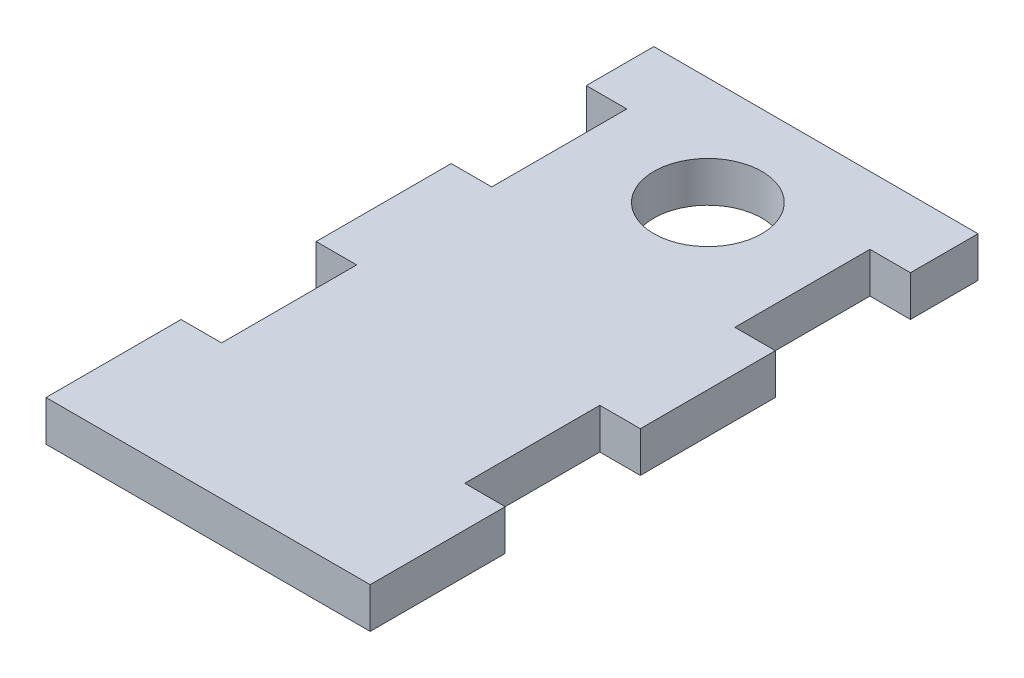
ISO-10303-21;
HEADER;
FILE_DESCRIPTION(('STEP AP214'),'2;1');
FILE_NAME('part.step','',(''),(''),'','','');
FILE_SCHEMA(('AUTOMOTIVE_DESIGN { 1 0 10303 214 1 1 1 1 }'));
ENDSEC;
DATA;
#1=APPLICATION_CONTEXT('core data for automotive mechanical design processes');
#2=APPLICATION_PROTOCOL_DEFINITION('international standard','automotive_design',2000,#1);
#3=PRODUCT_CONTEXT('',#1,'mechanical');
#4=PRODUCT('Part','Part','',(#3));
#5=PRODUCT_RELATED_PRODUCT_CATEGORY('part','',(#4));
#6=PRODUCT_DEFINITION_FORMATION('','',#4);
#7=PRODUCT_DEFINITION_CONTEXT('part definition',#1,'design');
#8=PRODUCT_DEFINITION('design','',#6,#7);
#9=PRODUCT_DEFINITION_SHAPE('','',#8);
#10=(LENGTH_UNIT() NAMED_UNIT(*) SI_UNIT(.MILLI.,.METRE.));
#11=(NAMED_UNIT(*) PLANE_ANGLE_UNIT() SI_UNIT($,.RADIAN.));
#12=(NAMED_UNIT(*) SI_UNIT($,.STERADIAN.) SOLID_ANGLE_UNIT());
#13=UNCERTAINTY_MEASURE_WITH_UNIT(LENGTH_MEASURE(1.E-05),#10,'distance_accuracy_value','');
#14=(GEOMETRIC_REPRESENTATION_CONTEXT(3) GLOBAL_UNCERTAINTY_ASSIGNED_CONTEXT((#13)) GLOBAL_UNIT_ASSIGNED_CONTEXT((#10,
#11,#12)) REPRESENTATION_CONTEXT('',''));
#15=CARTESIAN_POINT('',(0.,0.,0.));
#16=DIRECTION('',(0.,0.,1.));
#17=DIRECTION('',(1.,0.,0.));
#18=AXIS2_PLACEMENT_3D('',#15,#16,#17);
#19=CARTESIAN_POINT('',(12.,3.,22.5));
#20=DIRECTION('',(-1.,0.,0.));
#21=DIRECTION('',(0.,0.,1.));
#22=AXIS2_PLACEMENT_3D('',#19,#20,#21);
#23=PLANE('',#22);
#24=DIRECTION('',(0.,0.,-1.));
#25=VECTOR('',#24,1.);
#26=CARTESIAN_POINT('',(12.,0.,22.5));
#27=LINE('',#26,#25);
#28=CARTESIAN_POINT('',(12.,0.,22.5));
#29=VERTEX_POINT('',#28);
#30=CARTESIAN_POINT('',(12.,0.,12.5));
#31=VERTEX_POINT('',#30);
#32=EDGE_CURVE('E185',#29,#31,#27,.T.);
#33=ORIENTED_EDGE('',*,*,#32,.T.);
#34=DIRECTION('',(0.,1.,0.));
#35=VECTOR('',#34,1.);
#36=CARTESIAN_POINT('',(12.,0.,12.5));
#37=LINE('',#36,#35);
#38=CARTESIAN_POINT('',(12.,3.,12.5));
#39=VERTEX_POINT('',#38);
#40=EDGE_CURVE('E169',#31,#39,#37,.T.);
#41=ORIENTED_EDGE('',*,*,#40,.T.);
#42=DIRECTION('',(0.,0.,-1.));
#43=VECTOR('',#42,1.);
#44=CARTESIAN_POINT('',(12.,3.,22.5));
#45=LINE('',#44,#43);
#46=CARTESIAN_POINT('',(12.,3.,22.5));
#47=VERTEX_POINT('',#46);
#48=EDGE_CURVE('E215',#47,#39,#45,.T.);
#49=ORIENTED_EDGE('',*,*,#48,.F.);
#50=DIRECTION('',(0.,-1.,0.));
#51=VECTOR('',#50,1.);
#52=CARTESIAN_POINT('',(12.,3.,22.5));
#53=LINE('',#52,#51);
#54=EDGE_CURVE('E40',#47,#29,#53,.T.);
#55=ORIENTED_EDGE('',*,*,#54,.T.);
#56=EDGE_LOOP('',(#33,#41,#49,#55));
#57=FACE_BOUND('',#56,.T.);
#58=ADVANCED_FACE('F32',(#57),#23,.F.);
#59=CARTESIAN_POINT('',(12.,3.,2.50000000000002));
#60=VERTEX_POINT('',#59);
#61=CARTESIAN_POINT('',(12.,3.,-7.49999999999998));
#62=VERTEX_POINT('',#61);
#63=EDGE_CURVE('E217',#60,#62,#45,.T.);
#64=ORIENTED_EDGE('',*,*,#63,.F.);
#65=DIRECTION('',(0.,1.,0.));
#66=VECTOR('',#65,1.);
#67=CARTESIAN_POINT('',(12.,0.,2.50000000000002));
#68=LINE('',#67,#66);
#69=CARTESIAN_POINT('',(12.,0.,2.50000000000002));
#70=VERTEX_POINT('',#69);
#71=EDGE_CURVE('E179',#70,#60,#68,.T.);
#72=ORIENTED_EDGE('',*,*,#71,.F.);
#73=CARTESIAN_POINT('',(12.,0.,-7.49999999999998));
#74=VERTEX_POINT('',#73);
#75=EDGE_CURVE('E193',#70,#74,#27,.T.);
#76=ORIENTED_EDGE('',*,*,#75,.T.);
#77=DIRECTION('',(0.,1.,0.));
#78=VECTOR('',#77,1.);
#79=CARTESIAN_POINT('',(12.,0.,-7.49999999999998));
#80=LINE('',#79,#78);
#81=EDGE_CURVE('E285',#74,#62,#80,.T.);
#82=ORIENTED_EDGE('',*,*,#81,.T.);
#83=EDGE_LOOP('',(#64,#72,#76,#82));
#84=FACE_BOUND('',#83,.T.);
#85=ADVANCED_FACE('F328',(#84),#23,.F.);
#86=CARTESIAN_POINT('',(-12.,3.,22.5));
#87=DIRECTION('',(1.,0.,0.));
#88=DIRECTION('',(0.,0.,-1.));
#89=AXIS2_PLACEMENT_3D('',#86,#87,#88);
#90=PLANE('',#89);
#91=DIRECTION('',(0.,0.,1.));
#92=VECTOR('',#91,1.);
#93=CARTESIAN_POINT('',(-12.,0.,22.5));
#94=LINE('',#93,#92);
#95=CARTESIAN_POINT('',(-12.,0.,-22.5));
#96=VERTEX_POINT('',#95);
#97=CARTESIAN_POINT('',(-12.,0.,-17.5));
#98=VERTEX_POINT('',#97);
#99=EDGE_CURVE('E205',#96,#98,#94,.T.);
#100=ORIENTED_EDGE('',*,*,#99,.T.);
#101=DIRECTION('',(0.,1.,0.));
#102=VECTOR('',#101,1.);
#103=CARTESIAN_POINT('',(-12.,0.,-17.5));
#104=LINE('',#103,#102);
#105=CARTESIAN_POINT('',(-12.,3.,-17.5));
#106=VERTEX_POINT('',#105);
#107=EDGE_CURVE('E256',#98,#106,#104,.T.);
#108=ORIENTED_EDGE('',*,*,#107,.T.);
#109=DIRECTION('',(0.,0.,1.));
#110=VECTOR('',#109,1.);
#111=CARTESIAN_POINT('',(-12.,3.,22.5));
#112=LINE('',#111,#110);
#113=CARTESIAN_POINT('',(-12.,3.,-22.5));
#114=VERTEX_POINT('',#113);
#115=EDGE_CURVE('E221',#114,#106,#112,.T.);
#116=ORIENTED_EDGE('',*,*,#115,.F.);
#117=DIRECTION('',(0.,-1.,0.));
#118=VECTOR('',#117,1.);
#119=CARTESIAN_POINT('',(-12.,3.,-22.5));
#120=LINE('',#119,#118);
#121=EDGE_CURVE('E214',#114,#96,#120,.T.);
#122=ORIENTED_EDGE('',*,*,#121,.T.);
#123=EDGE_LOOP('',(#100,#108,#116,#122));
#124=FACE_BOUND('',#123,.T.);
#125=ADVANCED_FACE('F350',(#124),#90,.F.);
#126=CARTESIAN_POINT('',(-12.,3.,-7.49999999999999));
#127=VERTEX_POINT('',#126);
#128=CARTESIAN_POINT('',(-12.,3.,2.50000000000001));
#129=VERTEX_POINT('',#128);
#130=EDGE_CURVE('E224',#127,#129,#112,.T.);
#131=ORIENTED_EDGE('',*,*,#130,.F.);
#132=DIRECTION('',(0.,1.,0.));
#133=VECTOR('',#132,1.);
#134=CARTESIAN_POINT('',(-12.,0.,-7.49999999999999));
#135=LINE('',#134,#133);
#136=CARTESIAN_POINT('',(-12.,0.,-7.49999999999999));
#137=VERTEX_POINT('',#136);
#138=EDGE_CURVE('E259',#137,#127,#135,.T.);
#139=ORIENTED_EDGE('',*,*,#138,.F.);
#140=CARTESIAN_POINT('',(-12.,0.,2.50000000000001));
#141=VERTEX_POINT('',#140);
#142=EDGE_CURVE('E208',#137,#141,#94,.T.);
#143=ORIENTED_EDGE('',*,*,#142,.T.);
#144=DIRECTION('',(0.,1.,0.));
#145=VECTOR('',#144,1.);
#146=CARTESIAN_POINT('',(-12.,0.,2.50000000000001));
#147=LINE('',#146,#145);
#148=EDGE_CURVE('E232',#141,#129,#147,.T.);
#149=ORIENTED_EDGE('',*,*,#148,.T.);
#150=EDGE_LOOP('',(#131,#139,#143,#149));
#151=FACE_BOUND('',#150,.T.);
#152=ADVANCED_FACE('F366',(#151),#90,.F.);
#153=CARTESIAN_POINT('',(-12.,3.,12.5));
#154=VERTEX_POINT('',#153);
#155=CARTESIAN_POINT('',(-12.,3.,22.5));
#156=VERTEX_POINT('',#155);
#157=EDGE_CURVE('E196',#154,#156,#112,.T.);
#158=ORIENTED_EDGE('',*,*,#157,.F.);
#159=DIRECTION('',(0.,1.,0.));
#160=VECTOR('',#159,1.);
#161=CARTESIAN_POINT('',(-12.,0.,12.5));
#162=LINE('',#161,#160);
#163=CARTESIAN_POINT('',(-12.,0.,12.5));
#164=VERTEX_POINT('',#163);
#165=EDGE_CURVE('E225',#164,#154,#162,.T.);
#166=ORIENTED_EDGE('',*,*,#165,.F.);
#167=CARTESIAN_POINT('',(-12.,0.,22.5));
#168=VERTEX_POINT('',#167);
#169=EDGE_CURVE('E210',#164,#168,#94,.T.);
#170=ORIENTED_EDGE('',*,*,#169,.T.);
#171=DIRECTION('',(0.,-1.,0.));
#172=VECTOR('',#171,1.);
#173=CARTESIAN_POINT('',(-12.,3.,22.5));
#174=LINE('',#173,#172);
#175=EDGE_CURVE('E11',#156,#168,#174,.T.);
#176=ORIENTED_EDGE('',*,*,#175,.F.);
#177=EDGE_LOOP('',(#158,#166,#170,#176));
#178=FACE_BOUND('',#177,.T.);
#179=ADVANCED_FACE('F34',(#178),#90,.F.);
#180=CARTESIAN_POINT('',(12.,3.,22.5));
#181=DIRECTION('',(0.,0.,-1.));
#182=DIRECTION('',(-1.,0.,0.));
#183=AXIS2_PLACEMENT_3D('',#180,#181,#182);
#184=PLANE('',#183);
#185=DIRECTION('',(1.,0.,0.));
#186=VECTOR('',#185,1.);
#187=CARTESIAN_POINT('',(12.,0.,22.5));
#188=LINE('',#187,#186);
#189=EDGE_CURVE('E199',#168,#29,#188,.T.);
#190=ORIENTED_EDGE('',*,*,#189,.T.);
#191=ORIENTED_EDGE('',*,*,#54,.F.);
#192=DIRECTION('',(1.,0.,0.));
#193=VECTOR('',#192,1.);
#194=CARTESIAN_POINT('',(12.,3.,22.5));
#195=LINE('',#194,#193);
#196=EDGE_CURVE('E219',#156,#47,#195,.T.);
#197=ORIENTED_EDGE('',*,*,#196,.F.);
#198=ORIENTED_EDGE('',*,*,#175,.T.);
#199=EDGE_LOOP('',(#190,#191,#197,#198));
#200=FACE_BOUND('',#199,.T.);
#201=ADVANCED_FACE('F376',(#200),#184,.F.);
#202=CARTESIAN_POINT('',(12.,3.,-17.5));
#203=VERTEX_POINT('',#202);
#204=CARTESIAN_POINT('',(12.,3.,-22.5));
#205=VERTEX_POINT('',#204);
#206=EDGE_CURVE('E218',#203,#205,#45,.T.);
#207=ORIENTED_EDGE('',*,*,#206,.F.);
#208=DIRECTION('',(0.,1.,0.));
#209=VECTOR('',#208,1.);
#210=CARTESIAN_POINT('',(12.,0.,-17.5));
#211=LINE('',#210,#209);
#212=CARTESIAN_POINT('',(12.,0.,-17.5));
#213=VERTEX_POINT('',#212);
#214=EDGE_CURVE('E288',#213,#203,#211,.T.);
#215=ORIENTED_EDGE('',*,*,#214,.F.);
#216=CARTESIAN_POINT('',(12.,0.,-22.5));
#217=VERTEX_POINT('',#216);
#218=EDGE_CURVE('E195',#213,#217,#27,.T.);
#219=ORIENTED_EDGE('',*,*,#218,.T.);
#220=DIRECTION('',(0.,-1.,0.));
#221=VECTOR('',#220,1.);
#222=CARTESIAN_POINT('',(12.,3.,-22.5));
#223=LINE('',#222,#221);
#224=EDGE_CURVE('E339',#205,#217,#223,.T.);
#225=ORIENTED_EDGE('',*,*,#224,.F.);
#226=EDGE_LOOP('',(#207,#215,#219,#225));
#227=FACE_BOUND('',#226,.T.);
#228=ADVANCED_FACE('F340',(#227),#23,.F.);
#229=CARTESIAN_POINT('',(12.,3.,-22.5));
#230=DIRECTION('',(0.,0.,1.));
#231=DIRECTION('',(1.,0.,0.));
#232=AXIS2_PLACEMENT_3D('',#229,#230,#231);
#233=PLANE('',#232);
#234=DIRECTION('',(-1.,0.,0.));
#235=VECTOR('',#234,1.);
#236=CARTESIAN_POINT('',(12.,0.,-22.5));
#237=LINE('',#236,#235);
#238=EDGE_CURVE('E192',#217,#96,#237,.T.);
#239=ORIENTED_EDGE('',*,*,#238,.T.);
#240=ORIENTED_EDGE('',*,*,#121,.F.);
#241=DIRECTION('',(-1.,0.,0.));
#242=VECTOR('',#241,1.);
#243=CARTESIAN_POINT('',(12.,3.,-22.5));
#244=LINE('',#243,#242);
#245=EDGE_CURVE('E212',#205,#114,#244,.T.);
#246=ORIENTED_EDGE('',*,*,#245,.F.);
#247=ORIENTED_EDGE('',*,*,#224,.T.);
#248=EDGE_LOOP('',(#239,#240,#246,#247));
#249=FACE_BOUND('',#248,.T.);
#250=ADVANCED_FACE('F344',(#249),#233,.F.);
#251=CARTESIAN_POINT('',(0.,3.,0.));
#252=DIRECTION('',(0.,1.,0.));
#253=DIRECTION('',(0.,0.,1.));
#254=AXIS2_PLACEMENT_3D('',#251,#252,#253);
#255=PLANE('',#254);
#256=DIRECTION('',(1.,0.,0.));
#257=VECTOR('',#256,1.);
#258=CARTESIAN_POINT('',(12.,3.,12.5));
#259=LINE('',#258,#257);
#260=CARTESIAN_POINT('',(9.,3.,12.5));
#261=VERTEX_POINT('',#260);
#262=EDGE_CURVE('E174',#261,#39,#259,.T.);
#263=ORIENTED_EDGE('',*,*,#262,.F.);
#264=DIRECTION('',(0.,0.,1.));
#265=VECTOR('',#264,1.);
#266=CARTESIAN_POINT('',(9.,3.,12.5));
#267=LINE('',#266,#265);
#268=CARTESIAN_POINT('',(9.,3.,2.50000000000002));
#269=VERTEX_POINT('',#268);
#270=EDGE_CURVE('E188',#269,#261,#267,.T.);
#271=ORIENTED_EDGE('',*,*,#270,.F.);
#272=DIRECTION('',(-1.,0.,0.));
#273=VECTOR('',#272,1.);
#274=CARTESIAN_POINT('',(12.,3.,2.50000000000002));
#275=LINE('',#274,#273);
#276=EDGE_CURVE('E316',#60,#269,#275,.T.);
#277=ORIENTED_EDGE('',*,*,#276,.F.);
#278=ORIENTED_EDGE('',*,*,#63,.T.);
#279=DIRECTION('',(1.,0.,0.));
#280=VECTOR('',#279,1.);
#281=CARTESIAN_POINT('',(12.,3.,-7.49999999999998));
#282=LINE('',#281,#280);
#283=CARTESIAN_POINT('',(9.,3.,-7.49999999999998));
#284=VERTEX_POINT('',#283);
#285=EDGE_CURVE('E300',#284,#62,#282,.T.);
#286=ORIENTED_EDGE('',*,*,#285,.F.);
#287=DIRECTION('',(0.,0.,1.));
#288=VECTOR('',#287,1.);
#289=CARTESIAN_POINT('',(9.,3.,-7.49999999999998));
#290=LINE('',#289,#288);
#291=CARTESIAN_POINT('',(9.,3.,-17.5));
#292=VERTEX_POINT('',#291);
#293=EDGE_CURVE('E293',#292,#284,#290,.T.);
#294=ORIENTED_EDGE('',*,*,#293,.F.);
#295=DIRECTION('',(-1.,0.,0.));
#296=VECTOR('',#295,1.);
#297=CARTESIAN_POINT('',(12.,3.,-17.5));
#298=LINE('',#297,#296);
#299=EDGE_CURVE('E297',#203,#292,#298,.T.);
#300=ORIENTED_EDGE('',*,*,#299,.F.);
#301=ORIENTED_EDGE('',*,*,#206,.T.);
#302=ORIENTED_EDGE('',*,*,#245,.T.);
#303=ORIENTED_EDGE('',*,*,#115,.T.);
#304=DIRECTION('',(-1.,0.,0.));
#305=VECTOR('',#304,1.);
#306=CARTESIAN_POINT('',(-12.,3.,-17.5));
#307=LINE('',#306,#305);
#308=CARTESIAN_POINT('',(-9.00000000000001,3.,-17.5));
#309=VERTEX_POINT('',#308);
#310=EDGE_CURVE('E268',#309,#106,#307,.T.);
#311=ORIENTED_EDGE('',*,*,#310,.F.);
#312=DIRECTION('',(0.,0.,-1.));
#313=VECTOR('',#312,1.);
#314=CARTESIAN_POINT('',(-9.00000000000001,3.,-7.49999999999999));
#315=LINE('',#314,#313);
#316=CARTESIAN_POINT('',(-9.00000000000001,3.,-7.49999999999999));
#317=VERTEX_POINT('',#316);
#318=EDGE_CURVE('E271',#317,#309,#315,.T.);
#319=ORIENTED_EDGE('',*,*,#318,.F.);
#320=DIRECTION('',(1.,0.,0.));
#321=VECTOR('',#320,1.);
#322=CARTESIAN_POINT('',(-12.,3.,-7.49999999999999));
#323=LINE('',#322,#321);
#324=EDGE_CURVE('E274',#127,#317,#323,.T.);
#325=ORIENTED_EDGE('',*,*,#324,.F.);
#326=ORIENTED_EDGE('',*,*,#130,.T.);
#327=DIRECTION('',(-1.,0.,0.));
#328=VECTOR('',#327,1.);
#329=CARTESIAN_POINT('',(-12.,3.,2.50000000000001));
#330=LINE('',#329,#328);
#331=CARTESIAN_POINT('',(-9.00000000000001,3.,2.50000000000001));
#332=VERTEX_POINT('',#331);
#333=EDGE_CURVE('E235',#332,#129,#330,.T.);
#334=ORIENTED_EDGE('',*,*,#333,.F.);
#335=DIRECTION('',(0.,0.,-1.));
#336=VECTOR('',#335,1.);
#337=CARTESIAN_POINT('',(-9.00000000000001,3.,12.5));
#338=LINE('',#337,#336);
#339=CARTESIAN_POINT('',(-9.00000000000001,3.,12.5));
#340=VERTEX_POINT('',#339);
#341=EDGE_CURVE('E239',#340,#332,#338,.T.);
#342=ORIENTED_EDGE('',*,*,#341,.F.);
#343=DIRECTION('',(1.,0.,0.));
#344=VECTOR('',#343,1.);
#345=CARTESIAN_POINT('',(-12.,3.,12.5));
#346=LINE('',#345,#344);
#347=EDGE_CURVE('E242',#154,#340,#346,.T.);
#348=ORIENTED_EDGE('',*,*,#347,.F.);
#349=ORIENTED_EDGE('',*,*,#157,.T.);
#350=ORIENTED_EDGE('',*,*,#196,.T.);
#351=ORIENTED_EDGE('',*,*,#48,.T.);
#352=EDGE_LOOP('',(#263,#271,#277,#278,#286,#294,#300,#301,#302,#303,#311,#319,#325,#326,#334,
#342,#348,#349,#350,#351));
#353=FACE_BOUND('',#352,.T.);
#354=CARTESIAN_POINT('',(0.,3.,-14.5));
#355=DIRECTION('',(0.,1.,0.));
#356=DIRECTION('',(0.,0.,1.));
#357=AXIS2_PLACEMENT_3D('',#354,#355,#356);
#358=CIRCLE('',#357,4.);
#359=CARTESIAN_POINT('',(0.,3.,-10.5));
#360=VERTEX_POINT('',#359);
#361=EDGE_CURVE('E253',#360,#360,#358,.T.);
#362=ORIENTED_EDGE('',*,*,#361,.F.);
#363=EDGE_LOOP('',(#362));
#364=FACE_BOUND('',#363,.T.);
#365=ADVANCED_FACE('F334',(#353,#364),#255,.T.);
#366=CARTESIAN_POINT('',(0.,0.,0.));
#367=DIRECTION('',(0.,1.,0.));
#368=DIRECTION('',(0.,0.,1.));
#369=AXIS2_PLACEMENT_3D('',#366,#367,#368);
#370=PLANE('',#369);
#371=CARTESIAN_POINT('',(0.,0.,-14.5));
#372=DIRECTION('',(0.,1.,0.));
#373=DIRECTION('',(0.,0.,1.));
#374=AXIS2_PLACEMENT_3D('',#371,#372,#373);
#375=CIRCLE('',#374,4.);
#376=CARTESIAN_POINT('',(0.,0.,-10.5));
#377=VERTEX_POINT('',#376);
#378=EDGE_CURVE('E245',#377,#377,#375,.T.);
#379=ORIENTED_EDGE('',*,*,#378,.T.);
#380=EDGE_LOOP('',(#379));
#381=FACE_BOUND('',#380,.T.);
#382=DIRECTION('',(0.,0.,1.));
#383=VECTOR('',#382,1.);
#384=CARTESIAN_POINT('',(9.,0.,12.5));
#385=LINE('',#384,#383);
#386=CARTESIAN_POINT('',(9.,0.,2.50000000000002));
#387=VERTEX_POINT('',#386);
#388=CARTESIAN_POINT('',(9.,0.,12.5));
#389=VERTEX_POINT('',#388);
#390=EDGE_CURVE('E47',#387,#389,#385,.T.);
#391=ORIENTED_EDGE('',*,*,#390,.T.);
#392=DIRECTION('',(1.,0.,0.));
#393=VECTOR('',#392,1.);
#394=CARTESIAN_POINT('',(12.,0.,12.5));
#395=LINE('',#394,#393);
#396=EDGE_CURVE('E172',#389,#31,#395,.T.);
#397=ORIENTED_EDGE('',*,*,#396,.T.);
#398=ORIENTED_EDGE('',*,*,#32,.F.);
#399=ORIENTED_EDGE('',*,*,#189,.F.);
#400=ORIENTED_EDGE('',*,*,#169,.F.);
#401=DIRECTION('',(1.,0.,0.));
#402=VECTOR('',#401,1.);
#403=CARTESIAN_POINT('',(-12.,0.,12.5));
#404=LINE('',#403,#402);
#405=CARTESIAN_POINT('',(-9.00000000000001,0.,12.5));
#406=VERTEX_POINT('',#405);
#407=EDGE_CURVE('E238',#164,#406,#404,.T.);
#408=ORIENTED_EDGE('',*,*,#407,.T.);
#409=DIRECTION('',(0.,0.,-1.));
#410=VECTOR('',#409,1.);
#411=CARTESIAN_POINT('',(-9.00000000000001,0.,12.5));
#412=LINE('',#411,#410);
#413=CARTESIAN_POINT('',(-9.00000000000001,0.,2.50000000000001));
#414=VERTEX_POINT('',#413);
#415=EDGE_CURVE('E248',#406,#414,#412,.T.);
#416=ORIENTED_EDGE('',*,*,#415,.T.);
#417=DIRECTION('',(-1.,0.,0.));
#418=VECTOR('',#417,1.);
#419=CARTESIAN_POINT('',(-12.,0.,2.50000000000001));
#420=LINE('',#419,#418);
#421=EDGE_CURVE('E228',#414,#141,#420,.T.);
#422=ORIENTED_EDGE('',*,*,#421,.T.);
#423=ORIENTED_EDGE('',*,*,#142,.F.);
#424=DIRECTION('',(1.,0.,0.));
#425=VECTOR('',#424,1.);
#426=CARTESIAN_POINT('',(-12.,0.,-7.49999999999999));
#427=LINE('',#426,#425);
#428=CARTESIAN_POINT('',(-9.00000000000001,0.,-7.49999999999999));
#429=VERTEX_POINT('',#428);
#430=EDGE_CURVE('E270',#137,#429,#427,.T.);
#431=ORIENTED_EDGE('',*,*,#430,.T.);
#432=DIRECTION('',(0.,0.,-1.));
#433=VECTOR('',#432,1.);
#434=CARTESIAN_POINT('',(-9.00000000000001,0.,-7.49999999999999));
#435=LINE('',#434,#433);
#436=CARTESIAN_POINT('',(-9.00000000000001,0.,-17.5));
#437=VERTEX_POINT('',#436);
#438=EDGE_CURVE('E280',#429,#437,#435,.T.);
#439=ORIENTED_EDGE('',*,*,#438,.T.);
#440=DIRECTION('',(-1.,0.,0.));
#441=VECTOR('',#440,1.);
#442=CARTESIAN_POINT('',(-12.,0.,-17.5));
#443=LINE('',#442,#441);
#444=EDGE_CURVE('E262',#437,#98,#443,.T.);
#445=ORIENTED_EDGE('',*,*,#444,.T.);
#446=ORIENTED_EDGE('',*,*,#99,.F.);
#447=ORIENTED_EDGE('',*,*,#238,.F.);
#448=ORIENTED_EDGE('',*,*,#218,.F.);
#449=DIRECTION('',(-1.,0.,0.));
#450=VECTOR('',#449,1.);
#451=CARTESIAN_POINT('',(12.,0.,-17.5));
#452=LINE('',#451,#450);
#453=CARTESIAN_POINT('',(9.,0.,-17.5));
#454=VERTEX_POINT('',#453);
#455=EDGE_CURVE('E305',#213,#454,#452,.T.);
#456=ORIENTED_EDGE('',*,*,#455,.T.);
#457=DIRECTION('',(0.,0.,1.));
#458=VECTOR('',#457,1.);
#459=CARTESIAN_POINT('',(9.,0.,-7.49999999999998));
#460=LINE('',#459,#458);
#461=CARTESIAN_POINT('',(9.,0.,-7.49999999999998));
#462=VERTEX_POINT('',#461);
#463=EDGE_CURVE('E55',#454,#462,#460,.T.);
#464=ORIENTED_EDGE('',*,*,#463,.T.);
#465=DIRECTION('',(1.,0.,0.));
#466=VECTOR('',#465,1.);
#467=CARTESIAN_POINT('',(12.,0.,-7.49999999999998));
#468=LINE('',#467,#466);
#469=EDGE_CURVE('E296',#462,#74,#468,.T.);
#470=ORIENTED_EDGE('',*,*,#469,.T.);
#471=ORIENTED_EDGE('',*,*,#75,.F.);
#472=DIRECTION('',(-1.,0.,0.));
#473=VECTOR('',#472,1.);
#474=CARTESIAN_POINT('',(12.,0.,2.50000000000002));
#475=LINE('',#474,#473);
#476=EDGE_CURVE('E187',#70,#387,#475,.T.);
#477=ORIENTED_EDGE('',*,*,#476,.T.);
#478=EDGE_LOOP('',(#391,#397,#398,#399,#400,#408,#416,#422,#423,#431,#439,#445,#446,#447,#448,
#456,#464,#470,#471,#477));
#479=FACE_BOUND('',#478,.T.);
#480=ADVANCED_FACE('F183',(#381,#479),#370,.F.);
#481=CARTESIAN_POINT('',(-12.,0.,2.50000000000001));
#482=DIRECTION('',(0.,0.,-1.));
#483=DIRECTION('',(-1.,0.,0.));
#484=AXIS2_PLACEMENT_3D('',#481,#482,#483);
#485=PLANE('',#484);
#486=ORIENTED_EDGE('',*,*,#333,.T.);
#487=ORIENTED_EDGE('',*,*,#148,.F.);
#488=ORIENTED_EDGE('',*,*,#421,.F.);
#489=DIRECTION('',(0.,1.,0.));
#490=VECTOR('',#489,1.);
#491=CARTESIAN_POINT('',(-9.00000000000001,0.,2.50000000000001));
#492=LINE('',#491,#490);
#493=EDGE_CURVE('E230',#414,#332,#492,.T.);
#494=ORIENTED_EDGE('',*,*,#493,.T.);
#495=EDGE_LOOP('',(#486,#487,#488,#494));
#496=FACE_BOUND('',#495,.T.);
#497=ADVANCED_FACE('F380',(#496),#485,.F.);
#498=CARTESIAN_POINT('',(-9.00000000000001,0.,12.5));
#499=DIRECTION('',(1.,0.,0.));
#500=DIRECTION('',(0.,0.,-1.));
#501=AXIS2_PLACEMENT_3D('',#498,#499,#500);
#502=PLANE('',#501);
#503=ORIENTED_EDGE('',*,*,#341,.T.);
#504=ORIENTED_EDGE('',*,*,#493,.F.);
#505=ORIENTED_EDGE('',*,*,#415,.F.);
#506=DIRECTION('',(0.,1.,0.));
#507=VECTOR('',#506,1.);
#508=CARTESIAN_POINT('',(-9.00000000000001,0.,12.5));
#509=LINE('',#508,#507);
#510=EDGE_CURVE('E227',#406,#340,#509,.T.);
#511=ORIENTED_EDGE('',*,*,#510,.T.);
#512=EDGE_LOOP('',(#503,#504,#505,#511));
#513=FACE_BOUND('',#512,.T.);
#514=ADVANCED_FACE('F383',(#513),#502,.F.);
#515=CARTESIAN_POINT('',(-12.,0.,12.5));
#516=DIRECTION('',(0.,0.,1.));
#517=DIRECTION('',(1.,0.,0.));
#518=AXIS2_PLACEMENT_3D('',#515,#516,#517);
#519=PLANE('',#518);
#520=ORIENTED_EDGE('',*,*,#347,.T.);
#521=ORIENTED_EDGE('',*,*,#510,.F.);
#522=ORIENTED_EDGE('',*,*,#407,.F.);
#523=ORIENTED_EDGE('',*,*,#165,.T.);
#524=EDGE_LOOP('',(#520,#521,#522,#523));
#525=FACE_BOUND('',#524,.T.);
#526=ADVANCED_FACE('F385',(#525),#519,.F.);
#527=CARTESIAN_POINT('',(0.,0.,-14.5));
#528=DIRECTION('',(0.,1.,0.));
#529=DIRECTION('',(0.,0.,1.));
#530=AXIS2_PLACEMENT_3D('',#527,#528,#529);
#531=CYLINDRICAL_SURFACE('',#530,4.);
#532=ORIENTED_EDGE('',*,*,#378,.F.);
#533=EDGE_LOOP('',(#532));
#534=FACE_BOUND('',#533,.T.);
#535=ORIENTED_EDGE('',*,*,#361,.T.);
#536=EDGE_LOOP('',(#535));
#537=FACE_BOUND('',#536,.T.);
#538=ADVANCED_FACE('F387',(#534,#537),#531,.F.);
#539=CARTESIAN_POINT('',(-12.,0.,-17.5));
#540=DIRECTION('',(0.,0.,-1.));
#541=DIRECTION('',(-1.,0.,0.));
#542=AXIS2_PLACEMENT_3D('',#539,#540,#541);
#543=PLANE('',#542);
#544=ORIENTED_EDGE('',*,*,#310,.T.);
#545=ORIENTED_EDGE('',*,*,#107,.F.);
#546=ORIENTED_EDGE('',*,*,#444,.F.);
#547=DIRECTION('',(0.,1.,0.));
#548=VECTOR('',#547,1.);
#549=CARTESIAN_POINT('',(-9.00000000000001,0.,-17.5));
#550=LINE('',#549,#548);
#551=EDGE_CURVE('E264',#437,#309,#550,.T.);
#552=ORIENTED_EDGE('',*,*,#551,.T.);
#553=EDGE_LOOP('',(#544,#545,#546,#552));
#554=FACE_BOUND('',#553,.T.);
#555=ADVANCED_FACE('F355',(#554),#543,.F.);
#556=CARTESIAN_POINT('',(-9.00000000000001,0.,-7.49999999999999));
#557=DIRECTION('',(1.,0.,0.));
#558=DIRECTION('',(0.,0.,-1.));
#559=AXIS2_PLACEMENT_3D('',#556,#557,#558);
#560=PLANE('',#559);
#561=ORIENTED_EDGE('',*,*,#318,.T.);
#562=ORIENTED_EDGE('',*,*,#551,.F.);
#563=ORIENTED_EDGE('',*,*,#438,.F.);
#564=DIRECTION('',(0.,1.,0.));
#565=VECTOR('',#564,1.);
#566=CARTESIAN_POINT('',(-9.00000000000001,0.,-7.49999999999999));
#567=LINE('',#566,#565);
#568=EDGE_CURVE('E261',#429,#317,#567,.T.);
#569=ORIENTED_EDGE('',*,*,#568,.T.);
#570=EDGE_LOOP('',(#561,#562,#563,#569));
#571=FACE_BOUND('',#570,.T.);
#572=ADVANCED_FACE('F358',(#571),#560,.F.);
#573=CARTESIAN_POINT('',(-12.,0.,-7.49999999999999));
#574=DIRECTION('',(0.,0.,1.));
#575=DIRECTION('',(1.,0.,0.));
#576=AXIS2_PLACEMENT_3D('',#573,#574,#575);
#577=PLANE('',#576);
#578=ORIENTED_EDGE('',*,*,#324,.T.);
#579=ORIENTED_EDGE('',*,*,#568,.F.);
#580=ORIENTED_EDGE('',*,*,#430,.F.);
#581=ORIENTED_EDGE('',*,*,#138,.T.);
#582=EDGE_LOOP('',(#578,#579,#580,#581));
#583=FACE_BOUND('',#582,.T.);
#584=ADVANCED_FACE('F361',(#583),#577,.F.);
#585=CARTESIAN_POINT('',(12.,0.,-7.49999999999998));
#586=DIRECTION('',(0.,0.,1.));
#587=DIRECTION('',(1.,0.,0.));
#588=AXIS2_PLACEMENT_3D('',#585,#586,#587);
#589=PLANE('',#588);
#590=ORIENTED_EDGE('',*,*,#285,.T.);
#591=ORIENTED_EDGE('',*,*,#81,.F.);
#592=ORIENTED_EDGE('',*,*,#469,.F.);
#593=DIRECTION('',(0.,1.,0.));
#594=VECTOR('',#593,1.);
#595=CARTESIAN_POINT('',(9.,0.,-7.49999999999998));
#596=LINE('',#595,#594);
#597=EDGE_CURVE('E277',#462,#284,#596,.T.);
#598=ORIENTED_EDGE('',*,*,#597,.T.);
#599=EDGE_LOOP('',(#590,#591,#592,#598));
#600=FACE_BOUND('',#599,.T.);
#601=ADVANCED_FACE('F499',(#600),#589,.F.);
#602=CARTESIAN_POINT('',(9.,0.,-7.49999999999998));
#603=DIRECTION('',(-1.,0.,0.));
#604=DIRECTION('',(0.,0.,1.));
#605=AXIS2_PLACEMENT_3D('',#602,#603,#604);
#606=PLANE('',#605);
#607=ORIENTED_EDGE('',*,*,#293,.T.);
#608=ORIENTED_EDGE('',*,*,#597,.F.);
#609=ORIENTED_EDGE('',*,*,#463,.F.);
#610=DIRECTION('',(0.,1.,0.));
#611=VECTOR('',#610,1.);
#612=CARTESIAN_POINT('',(9.,0.,-17.5));
#613=LINE('',#612,#611);
#614=EDGE_CURVE('E290',#454,#292,#613,.T.);
#615=ORIENTED_EDGE('',*,*,#614,.T.);
#616=EDGE_LOOP('',(#607,#608,#609,#615));
#617=FACE_BOUND('',#616,.T.);
#618=ADVANCED_FACE('F508',(#617),#606,.F.);
#619=CARTESIAN_POINT('',(12.,0.,-17.5));
#620=DIRECTION('',(0.,0.,-1.));
#621=DIRECTION('',(-1.,0.,0.));
#622=AXIS2_PLACEMENT_3D('',#619,#620,#621);
#623=PLANE('',#622);
#624=ORIENTED_EDGE('',*,*,#299,.T.);
#625=ORIENTED_EDGE('',*,*,#614,.F.);
#626=ORIENTED_EDGE('',*,*,#455,.F.);
#627=ORIENTED_EDGE('',*,*,#214,.T.);
#628=EDGE_LOOP('',(#624,#625,#626,#627));
#629=FACE_BOUND('',#628,.T.);
#630=ADVANCED_FACE('F518',(#629),#623,.F.);
#631=CARTESIAN_POINT('',(12.,0.,12.5));
#632=DIRECTION('',(0.,0.,1.));
#633=DIRECTION('',(1.,0.,0.));
#634=AXIS2_PLACEMENT_3D('',#631,#632,#633);
#635=PLANE('',#634);
#636=ORIENTED_EDGE('',*,*,#262,.T.);
#637=ORIENTED_EDGE('',*,*,#40,.F.);
#638=ORIENTED_EDGE('',*,*,#396,.F.);
#639=DIRECTION('',(0.,1.,0.));
#640=VECTOR('',#639,1.);
#641=CARTESIAN_POINT('',(9.,0.,12.5));
#642=LINE('',#641,#640);
#643=EDGE_CURVE('E303',#389,#261,#642,.T.);
#644=ORIENTED_EDGE('',*,*,#643,.T.);
#645=EDGE_LOOP('',(#636,#637,#638,#644));
#646=FACE_BOUND('',#645,.T.);
#647=ADVANCED_FACE('F171',(#646),#635,.F.);
#648=CARTESIAN_POINT('',(9.,0.,12.5));
#649=DIRECTION('',(-1.,0.,0.));
#650=DIRECTION('',(0.,0.,1.));
#651=AXIS2_PLACEMENT_3D('',#648,#649,#650);
#652=PLANE('',#651);
#653=ORIENTED_EDGE('',*,*,#270,.T.);
#654=ORIENTED_EDGE('',*,*,#643,.F.);
#655=ORIENTED_EDGE('',*,*,#390,.F.);
#656=DIRECTION('',(0.,1.,0.));
#657=VECTOR('',#656,1.);
#658=CARTESIAN_POINT('',(9.,0.,2.50000000000002));
#659=LINE('',#658,#657);
#660=EDGE_CURVE('E311',#387,#269,#659,.T.);
#661=ORIENTED_EDGE('',*,*,#660,.T.);
#662=EDGE_LOOP('',(#653,#654,#655,#661));
#663=FACE_BOUND('',#662,.T.);
#664=ADVANCED_FACE('F536',(#663),#652,.F.);
#665=CARTESIAN_POINT('',(12.,0.,2.50000000000002));
#666=DIRECTION('',(0.,0.,-1.));
#667=DIRECTION('',(-1.,0.,0.));
#668=AXIS2_PLACEMENT_3D('',#665,#666,#667);
#669=PLANE('',#668);
#670=ORIENTED_EDGE('',*,*,#276,.T.);
#671=ORIENTED_EDGE('',*,*,#660,.F.);
#672=ORIENTED_EDGE('',*,*,#476,.F.);
#673=ORIENTED_EDGE('',*,*,#71,.T.);
#674=EDGE_LOOP('',(#670,#671,#672,#673));
#675=FACE_BOUND('',#674,.T.);
#676=ADVANCED_FACE('F324',(#675),#669,.F.);
#677=CLOSED_SHELL('',(#58,#85,#125,#152,#179,#201,#228,#250,#365,#480,#497,#514,#526,#538,#555,
#572,#584,#601,#618,#630,#647,#664,#676));
#678=MANIFOLD_SOLID_BREP('B2',#677);
#679=ADVANCED_BREP_SHAPE_REPRESENTATION('',(#18,#678),#14);
#680=SHAPE_DEFINITION_REPRESENTATION(#9,#679);
ENDSEC;
END-ISO-10303-21;
